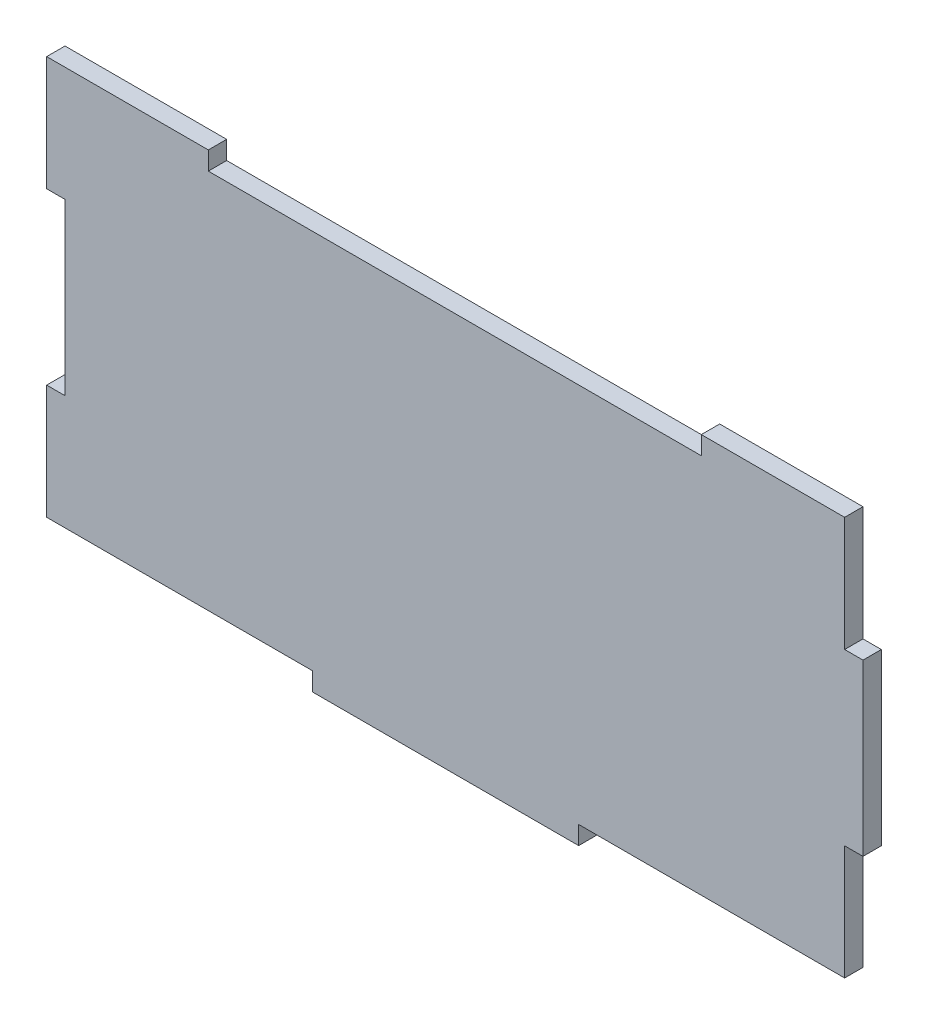
ISO-10303-21;
HEADER;
FILE_DESCRIPTION(('STEP AP214'),'2;1');
FILE_NAME('part.step','',(''),(''),'','','');
FILE_SCHEMA(('AUTOMOTIVE_DESIGN { 1 0 10303 214 1 1 1 1 }'));
ENDSEC;
DATA;
#1=APPLICATION_CONTEXT('core data for automotive mechanical design processes');
#2=APPLICATION_PROTOCOL_DEFINITION('international standard','automotive_design',2000,#1);
#3=PRODUCT_CONTEXT('',#1,'mechanical');
#4=PRODUCT('Part','Part','',(#3));
#5=PRODUCT_RELATED_PRODUCT_CATEGORY('part','',(#4));
#6=PRODUCT_DEFINITION_FORMATION('','',#4);
#7=PRODUCT_DEFINITION_CONTEXT('part definition',#1,'design');
#8=PRODUCT_DEFINITION('design','',#6,#7);
#9=PRODUCT_DEFINITION_SHAPE('','',#8);
#10=(LENGTH_UNIT() NAMED_UNIT(*) SI_UNIT(.MILLI.,.METRE.));
#11=(NAMED_UNIT(*) PLANE_ANGLE_UNIT() SI_UNIT($,.RADIAN.));
#12=(NAMED_UNIT(*) SI_UNIT($,.STERADIAN.) SOLID_ANGLE_UNIT());
#13=UNCERTAINTY_MEASURE_WITH_UNIT(LENGTH_MEASURE(1.E-05),#10,'distance_accuracy_value','');
#14=(GEOMETRIC_REPRESENTATION_CONTEXT(3) GLOBAL_UNCERTAINTY_ASSIGNED_CONTEXT((#13)) GLOBAL_UNIT_ASSIGNED_CONTEXT((#10,
#11,#12)) REPRESENTATION_CONTEXT('',''));
#15=CARTESIAN_POINT('',(0.,0.,0.));
#16=DIRECTION('',(0.,0.,1.));
#17=DIRECTION('',(1.,0.,0.));
#18=AXIS2_PLACEMENT_3D('',#15,#16,#17);
#19=CARTESIAN_POINT('',(0.,100.,4.6));
#20=DIRECTION('',(0.,-1.,0.));
#21=DIRECTION('',(0.,0.,-1.));
#22=AXIS2_PLACEMENT_3D('',#19,#20,#21);
#23=PLANE('',#22);
#24=DIRECTION('',(0.,0.,1.));
#25=VECTOR('',#24,1.);
#26=CARTESIAN_POINT('',(164.08357749269,99.9999999999319,0.));
#27=LINE('',#26,#25);
#28=CARTESIAN_POINT('',(164.08357749269,99.9999999999319,0.));
#29=VERTEX_POINT('',#28);
#30=CARTESIAN_POINT('',(164.08357749269,99.9999999999319,4.60000000000006));
#31=VERTEX_POINT('',#30);
#32=EDGE_CURVE('E579',#29,#31,#27,.T.);
#33=ORIENTED_EDGE('',*,*,#32,.T.);
#34=DIRECTION('',(-1.,0.,0.));
#35=VECTOR('',#34,1.);
#36=CARTESIAN_POINT('',(0.,100.,4.6));
#37=LINE('',#36,#35);
#38=CARTESIAN_POINT('',(200.,100.,4.6));
#39=VERTEX_POINT('',#38);
#40=EDGE_CURVE('E187',#39,#31,#37,.T.);
#41=ORIENTED_EDGE('',*,*,#40,.F.);
#42=DIRECTION('',(0.,0.,-1.));
#43=VECTOR('',#42,1.);
#44=CARTESIAN_POINT('',(200.,100.,4.6));
#45=LINE('',#44,#43);
#46=CARTESIAN_POINT('',(200.,100.,0.));
#47=VERTEX_POINT('',#46);
#48=EDGE_CURVE('E290',#39,#47,#45,.T.);
#49=ORIENTED_EDGE('',*,*,#48,.T.);
#50=DIRECTION('',(-1.,0.,0.));
#51=VECTOR('',#50,1.);
#52=CARTESIAN_POINT('',(0.,100.,0.));
#53=LINE('',#52,#51);
#54=EDGE_CURVE('E295',#47,#29,#53,.T.);
#55=ORIENTED_EDGE('',*,*,#54,.T.);
#56=EDGE_LOOP('',(#33,#41,#49,#55));
#57=FACE_BOUND('',#56,.T.);
#58=ADVANCED_FACE('F31',(#57),#23,.F.);
#59=DIRECTION('',(0.,0.,-1.));
#60=VECTOR('',#59,1.);
#61=CARTESIAN_POINT('',(40.51642250731,99.9999999999319,0.));
#62=LINE('',#61,#60);
#63=CARTESIAN_POINT('',(40.51642250731,99.9999999999319,4.60000000000007));
#64=VERTEX_POINT('',#63);
#65=CARTESIAN_POINT('',(40.51642250731,99.9999999999319,0.));
#66=VERTEX_POINT('',#65);
#67=EDGE_CURVE('E174',#64,#66,#62,.T.);
#68=ORIENTED_EDGE('',*,*,#67,.T.);
#69=CARTESIAN_POINT('',(0.,100.,0.));
#70=VERTEX_POINT('',#69);
#71=EDGE_CURVE('E299',#66,#70,#53,.T.);
#72=ORIENTED_EDGE('',*,*,#71,.T.);
#73=DIRECTION('',(0.,0.,-1.));
#74=VECTOR('',#73,1.);
#75=CARTESIAN_POINT('',(0.,100.,4.6));
#76=LINE('',#75,#74);
#77=CARTESIAN_POINT('',(0.,100.,4.6));
#78=VERTEX_POINT('',#77);
#79=EDGE_CURVE('E258',#78,#70,#76,.T.);
#80=ORIENTED_EDGE('',*,*,#79,.F.);
#81=EDGE_CURVE('E256',#64,#78,#37,.T.);
#82=ORIENTED_EDGE('',*,*,#81,.F.);
#83=EDGE_LOOP('',(#68,#72,#80,#82));
#84=FACE_BOUND('',#83,.T.);
#85=ADVANCED_FACE('F403',(#84),#23,.F.);
#86=CARTESIAN_POINT('',(0.,100.,4.6));
#87=DIRECTION('',(0.,0.,-1.));
#88=DIRECTION('',(-1.,0.,0.));
#89=AXIS2_PLACEMENT_3D('',#86,#87,#88);
#90=PLANE('',#89);
#91=DIRECTION('',(0.,1.,0.));
#92=VECTOR('',#91,1.);
#93=CARTESIAN_POINT('',(164.08357749269,95.3999999999319,4.60000000000006));
#94=LINE('',#93,#92);
#95=CARTESIAN_POINT('',(164.08357749269,95.3999999999319,4.60000000000006));
#96=VERTEX_POINT('',#95);
#97=EDGE_CURVE('E168',#96,#31,#94,.T.);
#98=ORIENTED_EDGE('',*,*,#97,.F.);
#99=DIRECTION('',(-1.,0.,0.));
#100=VECTOR('',#99,1.);
#101=CARTESIAN_POINT('',(40.51642250731,95.3999999999319,4.60000000000007));
#102=LINE('',#101,#100);
#103=CARTESIAN_POINT('',(40.51642250731,95.3999999999319,4.60000000000007));
#104=VERTEX_POINT('',#103);
#105=EDGE_CURVE('E173',#96,#104,#102,.T.);
#106=ORIENTED_EDGE('',*,*,#105,.T.);
#107=DIRECTION('',(0.,1.,0.));
#108=VECTOR('',#107,1.);
#109=CARTESIAN_POINT('',(40.51642250731,95.3999999999319,4.60000000000007));
#110=LINE('',#109,#108);
#111=EDGE_CURVE('E188',#104,#64,#110,.T.);
#112=ORIENTED_EDGE('',*,*,#111,.T.);
#113=ORIENTED_EDGE('',*,*,#81,.T.);
#114=DIRECTION('',(0.,-1.,0.));
#115=VECTOR('',#114,1.);
#116=CARTESIAN_POINT('',(0.,0.,4.6));
#117=LINE('',#116,#115);
#118=CARTESIAN_POINT('',(0.,71.3036640249381,4.6));
#119=VERTEX_POINT('',#118);
#120=EDGE_CURVE('E239',#78,#119,#117,.T.);
#121=ORIENTED_EDGE('',*,*,#120,.T.);
#122=DIRECTION('',(-1.,0.,0.));
#123=VECTOR('',#122,1.);
#124=CARTESIAN_POINT('',(0.,71.3036640249381,4.6));
#125=LINE('',#124,#123);
#126=CARTESIAN_POINT('',(4.6,71.3036640249381,4.6));
#127=VERTEX_POINT('',#126);
#128=EDGE_CURVE('E365',#127,#119,#125,.T.);
#129=ORIENTED_EDGE('',*,*,#128,.F.);
#130=DIRECTION('',(0.,1.,0.));
#131=VECTOR('',#130,1.);
#132=CARTESIAN_POINT('',(4.6,71.3036640249381,4.6));
#133=LINE('',#132,#131);
#134=CARTESIAN_POINT('',(4.59999999999999,28.6963359750618,4.6));
#135=VERTEX_POINT('',#134);
#136=EDGE_CURVE('E380',#135,#127,#133,.T.);
#137=ORIENTED_EDGE('',*,*,#136,.F.);
#138=DIRECTION('',(1.,0.,0.));
#139=VECTOR('',#138,1.);
#140=CARTESIAN_POINT('',(0.,28.6963359750618,4.6));
#141=LINE('',#140,#139);
#142=CARTESIAN_POINT('',(0.,28.6963359750618,4.6));
#143=VERTEX_POINT('',#142);
#144=EDGE_CURVE('E227',#143,#135,#141,.T.);
#145=ORIENTED_EDGE('',*,*,#144,.F.);
#146=CARTESIAN_POINT('',(0.,0.,4.6));
#147=VERTEX_POINT('',#146);
#148=EDGE_CURVE('E298',#143,#147,#117,.T.);
#149=ORIENTED_EDGE('',*,*,#148,.T.);
#150=DIRECTION('',(1.,0.,0.));
#151=VECTOR('',#150,1.);
#152=CARTESIAN_POINT('',(0.,0.,4.6));
#153=LINE('',#152,#151);
#154=CARTESIAN_POINT('',(66.6666666666667,0.,4.6));
#155=VERTEX_POINT('',#154);
#156=EDGE_CURVE('E238',#147,#155,#153,.T.);
#157=ORIENTED_EDGE('',*,*,#156,.T.);
#158=DIRECTION('',(0.,-1.,0.));
#159=VECTOR('',#158,1.);
#160=CARTESIAN_POINT('',(66.6666666666667,0.,4.6));
#161=LINE('',#160,#159);
#162=CARTESIAN_POINT('',(66.6666666666667,-4.60000000000001,4.6));
#163=VERTEX_POINT('',#162);
#164=EDGE_CURVE('E53',#155,#163,#161,.T.);
#165=ORIENTED_EDGE('',*,*,#164,.T.);
#166=DIRECTION('',(1.,0.,0.));
#167=VECTOR('',#166,1.);
#168=CARTESIAN_POINT('',(133.333333333333,-4.6,4.6));
#169=LINE('',#168,#167);
#170=CARTESIAN_POINT('',(133.333333333333,-4.6,4.6));
#171=VERTEX_POINT('',#170);
#172=EDGE_CURVE('E196',#163,#171,#169,.T.);
#173=ORIENTED_EDGE('',*,*,#172,.T.);
#174=DIRECTION('',(0.,1.,0.));
#175=VECTOR('',#174,1.);
#176=CARTESIAN_POINT('',(133.333333333333,0.,4.6));
#177=LINE('',#176,#175);
#178=CARTESIAN_POINT('',(133.333333333333,0.,4.6));
#179=VERTEX_POINT('',#178);
#180=EDGE_CURVE('E190',#171,#179,#177,.T.);
#181=ORIENTED_EDGE('',*,*,#180,.T.);
#182=CARTESIAN_POINT('',(200.,0.,4.6));
#183=VERTEX_POINT('',#182);
#184=EDGE_CURVE('E235',#179,#183,#153,.T.);
#185=ORIENTED_EDGE('',*,*,#184,.T.);
#186=DIRECTION('',(0.,1.,0.));
#187=VECTOR('',#186,1.);
#188=CARTESIAN_POINT('',(200.,0.,4.6));
#189=LINE('',#188,#187);
#190=CARTESIAN_POINT('',(200.,28.6963359750619,4.6));
#191=VERTEX_POINT('',#190);
#192=EDGE_CURVE('E245',#183,#191,#189,.T.);
#193=ORIENTED_EDGE('',*,*,#192,.T.);
#194=DIRECTION('',(1.,0.,0.));
#195=VECTOR('',#194,1.);
#196=CARTESIAN_POINT('',(200.,28.6963359750619,4.6));
#197=LINE('',#196,#195);
#198=CARTESIAN_POINT('',(204.6,28.6963359750619,4.6));
#199=VERTEX_POINT('',#198);
#200=EDGE_CURVE('E248',#191,#199,#197,.T.);
#201=ORIENTED_EDGE('',*,*,#200,.T.);
#202=DIRECTION('',(0.,1.,0.));
#203=VECTOR('',#202,1.);
#204=CARTESIAN_POINT('',(204.6,28.6963359750619,4.6));
#205=LINE('',#204,#203);
#206=CARTESIAN_POINT('',(204.6,71.3036640249381,4.6));
#207=VERTEX_POINT('',#206);
#208=EDGE_CURVE('E250',#199,#207,#205,.T.);
#209=ORIENTED_EDGE('',*,*,#208,.T.);
#210=DIRECTION('',(-1.,0.,0.));
#211=VECTOR('',#210,1.);
#212=CARTESIAN_POINT('',(200.,71.3036640249381,4.6));
#213=LINE('',#212,#211);
#214=CARTESIAN_POINT('',(200.,71.3036640249381,4.6));
#215=VERTEX_POINT('',#214);
#216=EDGE_CURVE('E252',#207,#215,#213,.T.);
#217=ORIENTED_EDGE('',*,*,#216,.T.);
#218=DIRECTION('',(0.,1.,0.));
#219=VECTOR('',#218,1.);
#220=CARTESIAN_POINT('',(200.,71.3036640249381,4.6));
#221=LINE('',#220,#219);
#222=EDGE_CURVE('E254',#215,#39,#221,.T.);
#223=ORIENTED_EDGE('',*,*,#222,.T.);
#224=ORIENTED_EDGE('',*,*,#40,.T.);
#225=EDGE_LOOP('',(#98,#106,#112,#113,#121,#129,#137,#145,#149,#157,#165,#173,#181,#185,#193,
#201,#209,#217,#223,#224));
#226=FACE_BOUND('',#225,.T.);
#227=ADVANCED_FACE('F185',(#226),#90,.F.);
#228=CARTESIAN_POINT('',(0.,100.,0.));
#229=DIRECTION('',(0.,0.,-1.));
#230=DIRECTION('',(-1.,0.,0.));
#231=AXIS2_PLACEMENT_3D('',#228,#229,#230);
#232=PLANE('',#231);
#233=DIRECTION('',(0.,-1.,0.));
#234=VECTOR('',#233,1.);
#235=CARTESIAN_POINT('',(0.,0.,0.));
#236=LINE('',#235,#234);
#237=CARTESIAN_POINT('',(0.,71.3036640249381,0.));
#238=VERTEX_POINT('',#237);
#239=EDGE_CURVE('E259',#70,#238,#236,.T.);
#240=ORIENTED_EDGE('',*,*,#239,.F.);
#241=ORIENTED_EDGE('',*,*,#71,.F.);
#242=DIRECTION('',(0.,1.,0.));
#243=VECTOR('',#242,1.);
#244=CARTESIAN_POINT('',(40.51642250731,95.3999999999319,0.));
#245=LINE('',#244,#243);
#246=CARTESIAN_POINT('',(40.51642250731,95.3999999999319,0.));
#247=VERTEX_POINT('',#246);
#248=EDGE_CURVE('E192',#247,#66,#245,.T.);
#249=ORIENTED_EDGE('',*,*,#248,.F.);
#250=DIRECTION('',(-1.,0.,0.));
#251=VECTOR('',#250,1.);
#252=CARTESIAN_POINT('',(0.,95.3999999999319,0.));
#253=LINE('',#252,#251);
#254=CARTESIAN_POINT('',(164.08357749269,95.3999999999319,0.));
#255=VERTEX_POINT('',#254);
#256=EDGE_CURVE('E11',#255,#247,#253,.T.);
#257=ORIENTED_EDGE('',*,*,#256,.F.);
#258=DIRECTION('',(0.,1.,0.));
#259=VECTOR('',#258,1.);
#260=CARTESIAN_POINT('',(164.08357749269,95.3999999999319,0.));
#261=LINE('',#260,#259);
#262=EDGE_CURVE('E171',#255,#29,#261,.T.);
#263=ORIENTED_EDGE('',*,*,#262,.T.);
#264=ORIENTED_EDGE('',*,*,#54,.F.);
#265=DIRECTION('',(0.,1.,0.));
#266=VECTOR('',#265,1.);
#267=CARTESIAN_POINT('',(200.,71.3036640249381,0.));
#268=LINE('',#267,#266);
#269=CARTESIAN_POINT('',(200.,71.3036640249381,0.));
#270=VERTEX_POINT('',#269);
#271=EDGE_CURVE('E300',#270,#47,#268,.T.);
#272=ORIENTED_EDGE('',*,*,#271,.F.);
#273=DIRECTION('',(-1.,0.,0.));
#274=VECTOR('',#273,1.);
#275=CARTESIAN_POINT('',(200.,71.3036640249381,0.));
#276=LINE('',#275,#274);
#277=CARTESIAN_POINT('',(204.6,71.3036640249381,0.));
#278=VERTEX_POINT('',#277);
#279=EDGE_CURVE('E302',#278,#270,#276,.T.);
#280=ORIENTED_EDGE('',*,*,#279,.F.);
#281=DIRECTION('',(0.,1.,0.));
#282=VECTOR('',#281,1.);
#283=CARTESIAN_POINT('',(204.6,28.6963359750619,0.));
#284=LINE('',#283,#282);
#285=CARTESIAN_POINT('',(204.6,28.6963359750619,0.));
#286=VERTEX_POINT('',#285);
#287=EDGE_CURVE('E304',#286,#278,#284,.T.);
#288=ORIENTED_EDGE('',*,*,#287,.F.);
#289=DIRECTION('',(1.,0.,0.));
#290=VECTOR('',#289,1.);
#291=CARTESIAN_POINT('',(200.,28.6963359750619,0.));
#292=LINE('',#291,#290);
#293=CARTESIAN_POINT('',(200.,28.6963359750619,0.));
#294=VERTEX_POINT('',#293);
#295=EDGE_CURVE('E305',#294,#286,#292,.T.);
#296=ORIENTED_EDGE('',*,*,#295,.F.);
#297=DIRECTION('',(0.,1.,0.));
#298=VECTOR('',#297,1.);
#299=CARTESIAN_POINT('',(200.,0.,0.));
#300=LINE('',#299,#298);
#301=CARTESIAN_POINT('',(200.,0.,0.));
#302=VERTEX_POINT('',#301);
#303=EDGE_CURVE('E266',#302,#294,#300,.T.);
#304=ORIENTED_EDGE('',*,*,#303,.F.);
#305=DIRECTION('',(1.,0.,0.));
#306=VECTOR('',#305,1.);
#307=CARTESIAN_POINT('',(0.,0.,0.));
#308=LINE('',#307,#306);
#309=CARTESIAN_POINT('',(133.333333333333,0.,0.));
#310=VERTEX_POINT('',#309);
#311=EDGE_CURVE('E262',#310,#302,#308,.T.);
#312=ORIENTED_EDGE('',*,*,#311,.F.);
#313=DIRECTION('',(0.,1.,0.));
#314=VECTOR('',#313,1.);
#315=CARTESIAN_POINT('',(133.333333333333,0.,0.));
#316=LINE('',#315,#314);
#317=CARTESIAN_POINT('',(133.333333333333,-4.6,0.));
#318=VERTEX_POINT('',#317);
#319=EDGE_CURVE('E206',#318,#310,#316,.T.);
#320=ORIENTED_EDGE('',*,*,#319,.F.);
#321=DIRECTION('',(1.,0.,0.));
#322=VECTOR('',#321,1.);
#323=CARTESIAN_POINT('',(133.333333333333,-4.6,0.));
#324=LINE('',#323,#322);
#325=CARTESIAN_POINT('',(66.6666666666667,-4.60000000000001,0.));
#326=VERTEX_POINT('',#325);
#327=EDGE_CURVE('E200',#326,#318,#324,.T.);
#328=ORIENTED_EDGE('',*,*,#327,.F.);
#329=DIRECTION('',(0.,-1.,0.));
#330=VECTOR('',#329,1.);
#331=CARTESIAN_POINT('',(66.6666666666667,0.,0.));
#332=LINE('',#331,#330);
#333=CARTESIAN_POINT('',(66.6666666666667,0.,0.));
#334=VERTEX_POINT('',#333);
#335=EDGE_CURVE('E208',#334,#326,#332,.T.);
#336=ORIENTED_EDGE('',*,*,#335,.F.);
#337=CARTESIAN_POINT('',(0.,0.,0.));
#338=VERTEX_POINT('',#337);
#339=EDGE_CURVE('E270',#338,#334,#308,.T.);
#340=ORIENTED_EDGE('',*,*,#339,.F.);
#341=CARTESIAN_POINT('',(0.,28.6963359750618,0.));
#342=VERTEX_POINT('',#341);
#343=EDGE_CURVE('E263',#342,#338,#236,.T.);
#344=ORIENTED_EDGE('',*,*,#343,.F.);
#345=DIRECTION('',(1.,0.,0.));
#346=VECTOR('',#345,1.);
#347=CARTESIAN_POINT('',(0.,28.6963359750618,0.));
#348=LINE('',#347,#346);
#349=CARTESIAN_POINT('',(4.59999999999999,28.6963359750618,0.));
#350=VERTEX_POINT('',#349);
#351=EDGE_CURVE('E377',#342,#350,#348,.T.);
#352=ORIENTED_EDGE('',*,*,#351,.T.);
#353=DIRECTION('',(0.,1.,0.));
#354=VECTOR('',#353,1.);
#355=CARTESIAN_POINT('',(4.6,71.3036640249381,0.));
#356=LINE('',#355,#354);
#357=CARTESIAN_POINT('',(4.6,71.3036640249381,0.));
#358=VERTEX_POINT('',#357);
#359=EDGE_CURVE('E373',#350,#358,#356,.T.);
#360=ORIENTED_EDGE('',*,*,#359,.T.);
#361=DIRECTION('',(-1.,0.,0.));
#362=VECTOR('',#361,1.);
#363=CARTESIAN_POINT('',(0.,71.3036640249381,0.));
#364=LINE('',#363,#362);
#365=EDGE_CURVE('E368',#358,#238,#364,.T.);
#366=ORIENTED_EDGE('',*,*,#365,.T.);
#367=EDGE_LOOP('',(#240,#241,#249,#257,#263,#264,#272,#280,#288,#296,#304,#312,#320,#328,#336,
#340,#344,#352,#360,#366));
#368=FACE_BOUND('',#367,.T.);
#369=ADVANCED_FACE('F321',(#368),#232,.T.);
#370=CARTESIAN_POINT('',(0.,0.,4.6));
#371=DIRECTION('',(0.,1.,0.));
#372=DIRECTION('',(0.,0.,1.));
#373=AXIS2_PLACEMENT_3D('',#370,#371,#372);
#374=PLANE('',#373);
#375=DIRECTION('',(0.,0.,1.));
#376=VECTOR('',#375,1.);
#377=CARTESIAN_POINT('',(133.333333333333,0.,-66.8251782223171));
#378=LINE('',#377,#376);
#379=EDGE_CURVE('E223',#310,#179,#378,.T.);
#380=ORIENTED_EDGE('',*,*,#379,.F.);
#381=ORIENTED_EDGE('',*,*,#311,.T.);
#382=DIRECTION('',(0.,0.,-1.));
#383=VECTOR('',#382,1.);
#384=CARTESIAN_POINT('',(200.,0.,4.6));
#385=LINE('',#384,#383);
#386=EDGE_CURVE('E275',#183,#302,#385,.T.);
#387=ORIENTED_EDGE('',*,*,#386,.F.);
#388=ORIENTED_EDGE('',*,*,#184,.F.);
#389=EDGE_LOOP('',(#380,#381,#387,#388));
#390=FACE_BOUND('',#389,.T.);
#391=ADVANCED_FACE('F336',(#390),#374,.F.);
#392=CARTESIAN_POINT('',(0.,0.,4.6));
#393=DIRECTION('',(1.,0.,0.));
#394=DIRECTION('',(0.,0.,-1.));
#395=AXIS2_PLACEMENT_3D('',#392,#393,#394);
#396=PLANE('',#395);
#397=ORIENTED_EDGE('',*,*,#239,.T.);
#398=DIRECTION('',(0.,0.,1.));
#399=VECTOR('',#398,1.);
#400=CARTESIAN_POINT('',(0.,71.3036640249381,0.));
#401=LINE('',#400,#399);
#402=EDGE_CURVE('E355',#238,#119,#401,.T.);
#403=ORIENTED_EDGE('',*,*,#402,.T.);
#404=ORIENTED_EDGE('',*,*,#120,.F.);
#405=ORIENTED_EDGE('',*,*,#79,.T.);
#406=EDGE_LOOP('',(#397,#403,#404,#405));
#407=FACE_BOUND('',#406,.T.);
#408=ADVANCED_FACE('F425',(#407),#396,.F.);
#409=ORIENTED_EDGE('',*,*,#148,.F.);
#410=DIRECTION('',(0.,0.,1.));
#411=VECTOR('',#410,1.);
#412=CARTESIAN_POINT('',(0.,28.6963359750618,0.));
#413=LINE('',#412,#411);
#414=EDGE_CURVE('E354',#342,#143,#413,.T.);
#415=ORIENTED_EDGE('',*,*,#414,.F.);
#416=ORIENTED_EDGE('',*,*,#343,.T.);
#417=DIRECTION('',(0.,0.,-1.));
#418=VECTOR('',#417,1.);
#419=CARTESIAN_POINT('',(0.,0.,4.6));
#420=LINE('',#419,#418);
#421=EDGE_CURVE('E39',#147,#338,#420,.T.);
#422=ORIENTED_EDGE('',*,*,#421,.F.);
#423=EDGE_LOOP('',(#409,#415,#416,#422));
#424=FACE_BOUND('',#423,.T.);
#425=ADVANCED_FACE('F33',(#424),#396,.F.);
#426=ORIENTED_EDGE('',*,*,#339,.T.);
#427=DIRECTION('',(0.,0.,1.));
#428=VECTOR('',#427,1.);
#429=CARTESIAN_POINT('',(66.6666666666667,0.,-66.8251782223171));
#430=LINE('',#429,#428);
#431=EDGE_CURVE('E199',#334,#155,#430,.T.);
#432=ORIENTED_EDGE('',*,*,#431,.T.);
#433=ORIENTED_EDGE('',*,*,#156,.F.);
#434=ORIENTED_EDGE('',*,*,#421,.T.);
#435=EDGE_LOOP('',(#426,#432,#433,#434));
#436=FACE_BOUND('',#435,.T.);
#437=ADVANCED_FACE('F350',(#436),#374,.F.);
#438=CARTESIAN_POINT('',(200.,0.,4.6));
#439=DIRECTION('',(-1.,0.,0.));
#440=DIRECTION('',(0.,0.,1.));
#441=AXIS2_PLACEMENT_3D('',#438,#439,#440);
#442=PLANE('',#441);
#443=ORIENTED_EDGE('',*,*,#303,.T.);
#444=DIRECTION('',(0.,0.,-1.));
#445=VECTOR('',#444,1.);
#446=CARTESIAN_POINT('',(200.,28.6963359750619,4.6));
#447=LINE('',#446,#445);
#448=EDGE_CURVE('E278',#191,#294,#447,.T.);
#449=ORIENTED_EDGE('',*,*,#448,.F.);
#450=ORIENTED_EDGE('',*,*,#192,.F.);
#451=ORIENTED_EDGE('',*,*,#386,.T.);
#452=EDGE_LOOP('',(#443,#449,#450,#451));
#453=FACE_BOUND('',#452,.T.);
#454=ADVANCED_FACE('F312',(#453),#442,.F.);
#455=CARTESIAN_POINT('',(200.,28.6963359750619,4.6));
#456=DIRECTION('',(0.,1.,0.));
#457=DIRECTION('',(0.,0.,1.));
#458=AXIS2_PLACEMENT_3D('',#455,#456,#457);
#459=PLANE('',#458);
#460=ORIENTED_EDGE('',*,*,#295,.T.);
#461=DIRECTION('',(0.,0.,-1.));
#462=VECTOR('',#461,1.);
#463=CARTESIAN_POINT('',(204.6,28.6963359750619,4.6));
#464=LINE('',#463,#462);
#465=EDGE_CURVE('E281',#199,#286,#464,.T.);
#466=ORIENTED_EDGE('',*,*,#465,.F.);
#467=ORIENTED_EDGE('',*,*,#200,.F.);
#468=ORIENTED_EDGE('',*,*,#448,.T.);
#469=EDGE_LOOP('',(#460,#466,#467,#468));
#470=FACE_BOUND('',#469,.T.);
#471=ADVANCED_FACE('F318',(#470),#459,.F.);
#472=CARTESIAN_POINT('',(204.6,28.6963359750619,4.6));
#473=DIRECTION('',(-1.,0.,0.));
#474=DIRECTION('',(0.,0.,1.));
#475=AXIS2_PLACEMENT_3D('',#472,#473,#474);
#476=PLANE('',#475);
#477=ORIENTED_EDGE('',*,*,#287,.T.);
#478=DIRECTION('',(0.,0.,-1.));
#479=VECTOR('',#478,1.);
#480=CARTESIAN_POINT('',(204.6,71.3036640249381,4.6));
#481=LINE('',#480,#479);
#482=EDGE_CURVE('E284',#207,#278,#481,.T.);
#483=ORIENTED_EDGE('',*,*,#482,.F.);
#484=ORIENTED_EDGE('',*,*,#208,.F.);
#485=ORIENTED_EDGE('',*,*,#465,.T.);
#486=EDGE_LOOP('',(#477,#483,#484,#485));
#487=FACE_BOUND('',#486,.T.);
#488=ADVANCED_FACE('F326',(#487),#476,.F.);
#489=CARTESIAN_POINT('',(200.,71.3036640249381,4.6));
#490=DIRECTION('',(0.,-1.,0.));
#491=DIRECTION('',(0.,0.,-1.));
#492=AXIS2_PLACEMENT_3D('',#489,#490,#491);
#493=PLANE('',#492);
#494=ORIENTED_EDGE('',*,*,#279,.T.);
#495=DIRECTION('',(0.,0.,-1.));
#496=VECTOR('',#495,1.);
#497=CARTESIAN_POINT('',(200.,71.3036640249381,4.6));
#498=LINE('',#497,#496);
#499=EDGE_CURVE('E287',#215,#270,#498,.T.);
#500=ORIENTED_EDGE('',*,*,#499,.F.);
#501=ORIENTED_EDGE('',*,*,#216,.F.);
#502=ORIENTED_EDGE('',*,*,#482,.T.);
#503=EDGE_LOOP('',(#494,#500,#501,#502));
#504=FACE_BOUND('',#503,.T.);
#505=ADVANCED_FACE('F330',(#504),#493,.F.);
#506=CARTESIAN_POINT('',(200.,71.3036640249381,4.6));
#507=DIRECTION('',(-1.,0.,0.));
#508=DIRECTION('',(0.,0.,1.));
#509=AXIS2_PLACEMENT_3D('',#506,#507,#508);
#510=PLANE('',#509);
#511=ORIENTED_EDGE('',*,*,#271,.T.);
#512=ORIENTED_EDGE('',*,*,#48,.F.);
#513=ORIENTED_EDGE('',*,*,#222,.F.);
#514=ORIENTED_EDGE('',*,*,#499,.T.);
#515=EDGE_LOOP('',(#511,#512,#513,#514));
#516=FACE_BOUND('',#515,.T.);
#517=ADVANCED_FACE('F391',(#516),#510,.F.);
#518=CARTESIAN_POINT('',(0.,71.3036640249381,0.));
#519=DIRECTION('',(0.,1.,0.));
#520=DIRECTION('',(0.,0.,1.));
#521=AXIS2_PLACEMENT_3D('',#518,#519,#520);
#522=PLANE('',#521);
#523=ORIENTED_EDGE('',*,*,#128,.T.);
#524=ORIENTED_EDGE('',*,*,#402,.F.);
#525=ORIENTED_EDGE('',*,*,#365,.F.);
#526=DIRECTION('',(0.,0.,1.));
#527=VECTOR('',#526,1.);
#528=CARTESIAN_POINT('',(4.6,71.3036640249381,0.));
#529=LINE('',#528,#527);
#530=EDGE_CURVE('E357',#358,#127,#529,.T.);
#531=ORIENTED_EDGE('',*,*,#530,.T.);
#532=EDGE_LOOP('',(#523,#524,#525,#531));
#533=FACE_BOUND('',#532,.T.);
#534=ADVANCED_FACE('F389',(#533),#522,.F.);
#535=CARTESIAN_POINT('',(4.6,71.3036640249381,0.));
#536=DIRECTION('',(1.,0.,0.));
#537=DIRECTION('',(0.,1.,0.));
#538=AXIS2_PLACEMENT_3D('',#535,#536,#537);
#539=PLANE('',#538);
#540=ORIENTED_EDGE('',*,*,#136,.T.);
#541=ORIENTED_EDGE('',*,*,#530,.F.);
#542=ORIENTED_EDGE('',*,*,#359,.F.);
#543=DIRECTION('',(0.,0.,1.));
#544=VECTOR('',#543,1.);
#545=CARTESIAN_POINT('',(4.59999999999999,28.6963359750618,0.));
#546=LINE('',#545,#544);
#547=EDGE_CURVE('E362',#350,#135,#546,.T.);
#548=ORIENTED_EDGE('',*,*,#547,.T.);
#549=EDGE_LOOP('',(#540,#541,#542,#548));
#550=FACE_BOUND('',#549,.T.);
#551=ADVANCED_FACE('F388',(#550),#539,.F.);
#552=CARTESIAN_POINT('',(0.,28.6963359750618,0.));
#553=DIRECTION('',(0.,-1.,0.));
#554=DIRECTION('',(1.,0.,0.));
#555=AXIS2_PLACEMENT_3D('',#552,#553,#554);
#556=PLANE('',#555);
#557=ORIENTED_EDGE('',*,*,#144,.T.);
#558=ORIENTED_EDGE('',*,*,#547,.F.);
#559=ORIENTED_EDGE('',*,*,#351,.F.);
#560=ORIENTED_EDGE('',*,*,#414,.T.);
#561=EDGE_LOOP('',(#557,#558,#559,#560));
#562=FACE_BOUND('',#561,.T.);
#563=ADVANCED_FACE('F387',(#562),#556,.F.);
#564=CARTESIAN_POINT('',(66.6666666666667,0.,-66.8251782223171));
#565=DIRECTION('',(-1.,0.,0.));
#566=DIRECTION('',(0.,0.,1.));
#567=AXIS2_PLACEMENT_3D('',#564,#565,#566);
#568=PLANE('',#567);
#569=ORIENTED_EDGE('',*,*,#431,.F.);
#570=ORIENTED_EDGE('',*,*,#335,.T.);
#571=DIRECTION('',(0.,0.,1.));
#572=VECTOR('',#571,1.);
#573=CARTESIAN_POINT('',(66.6666666666667,-4.60000000000001,-66.8251782223171));
#574=LINE('',#573,#572);
#575=EDGE_CURVE('E204',#326,#163,#574,.T.);
#576=ORIENTED_EDGE('',*,*,#575,.T.);
#577=ORIENTED_EDGE('',*,*,#164,.F.);
#578=EDGE_LOOP('',(#569,#570,#576,#577));
#579=FACE_BOUND('',#578,.T.);
#580=ADVANCED_FACE('F343',(#579),#568,.T.);
#581=CARTESIAN_POINT('',(133.333333333333,-4.6,-66.8251782223171));
#582=DIRECTION('',(0.,-1.,0.));
#583=DIRECTION('',(1.,0.,0.));
#584=AXIS2_PLACEMENT_3D('',#581,#582,#583);
#585=PLANE('',#584);
#586=ORIENTED_EDGE('',*,*,#575,.F.);
#587=ORIENTED_EDGE('',*,*,#327,.T.);
#588=DIRECTION('',(0.,0.,1.));
#589=VECTOR('',#588,1.);
#590=CARTESIAN_POINT('',(133.333333333333,-4.6,-66.8251782223171));
#591=LINE('',#590,#589);
#592=EDGE_CURVE('E203',#318,#171,#591,.T.);
#593=ORIENTED_EDGE('',*,*,#592,.T.);
#594=ORIENTED_EDGE('',*,*,#172,.F.);
#595=EDGE_LOOP('',(#586,#587,#593,#594));
#596=FACE_BOUND('',#595,.T.);
#597=ADVANCED_FACE('F342',(#596),#585,.T.);
#598=CARTESIAN_POINT('',(133.333333333333,0.,-66.8251782223171));
#599=DIRECTION('',(1.,0.,0.));
#600=DIRECTION('',(0.,0.,-1.));
#601=AXIS2_PLACEMENT_3D('',#598,#599,#600);
#602=PLANE('',#601);
#603=ORIENTED_EDGE('',*,*,#592,.F.);
#604=ORIENTED_EDGE('',*,*,#319,.T.);
#605=ORIENTED_EDGE('',*,*,#379,.T.);
#606=ORIENTED_EDGE('',*,*,#180,.F.);
#607=EDGE_LOOP('',(#603,#604,#605,#606));
#608=FACE_BOUND('',#607,.T.);
#609=ADVANCED_FACE('F340',(#608),#602,.T.);
#610=CARTESIAN_POINT('',(164.08357749269,95.3999999999319,0.));
#611=DIRECTION('',(-1.,0.,0.));
#612=DIRECTION('',(0.,0.,-1.));
#613=AXIS2_PLACEMENT_3D('',#610,#611,#612);
#614=PLANE('',#613);
#615=ORIENTED_EDGE('',*,*,#32,.F.);
#616=ORIENTED_EDGE('',*,*,#262,.F.);
#617=DIRECTION('',(0.,0.,1.));
#618=VECTOR('',#617,1.);
#619=CARTESIAN_POINT('',(164.08357749269,95.3999999999319,0.));
#620=LINE('',#619,#618);
#621=EDGE_CURVE('E45',#255,#96,#620,.T.);
#622=ORIENTED_EDGE('',*,*,#621,.T.);
#623=ORIENTED_EDGE('',*,*,#97,.T.);
#624=EDGE_LOOP('',(#615,#616,#622,#623));
#625=FACE_BOUND('',#624,.T.);
#626=ADVANCED_FACE('F166',(#625),#614,.T.);
#627=CARTESIAN_POINT('',(40.51642250731,95.3999999999319,0.));
#628=DIRECTION('',(1.,0.,0.));
#629=DIRECTION('',(0.,-1.,0.));
#630=AXIS2_PLACEMENT_3D('',#627,#628,#629);
#631=PLANE('',#630);
#632=ORIENTED_EDGE('',*,*,#67,.F.);
#633=ORIENTED_EDGE('',*,*,#111,.F.);
#634=DIRECTION('',(0.,0.,-1.));
#635=VECTOR('',#634,1.);
#636=CARTESIAN_POINT('',(40.51642250731,95.3999999999319,0.));
#637=LINE('',#636,#635);
#638=EDGE_CURVE('E180',#104,#247,#637,.T.);
#639=ORIENTED_EDGE('',*,*,#638,.T.);
#640=ORIENTED_EDGE('',*,*,#248,.T.);
#641=EDGE_LOOP('',(#632,#633,#639,#640));
#642=FACE_BOUND('',#641,.T.);
#643=ADVANCED_FACE('F450',(#642),#631,.T.);
#644=CARTESIAN_POINT('',(200.,95.3999999999319,-195.4));
#645=DIRECTION('',(0.,-1.,0.));
#646=DIRECTION('',(0.,0.,-1.));
#647=AXIS2_PLACEMENT_3D('',#644,#645,#646);
#648=PLANE('',#647);
#649=ORIENTED_EDGE('',*,*,#256,.T.);
#650=ORIENTED_EDGE('',*,*,#638,.F.);
#651=ORIENTED_EDGE('',*,*,#105,.F.);
#652=ORIENTED_EDGE('',*,*,#621,.F.);
#653=EDGE_LOOP('',(#649,#650,#651,#652));
#654=FACE_BOUND('',#653,.T.);
#655=ADVANCED_FACE('F178',(#654),#648,.F.);
#656=CLOSED_SHELL('',(#58,#85,#227,#369,#391,#408,#425,#437,#454,#471,#488,#505,#517,#534,#551,
#563,#580,#597,#609,#626,#643,#655));
#657=MANIFOLD_SOLID_BREP('B2',#656);
#658=ADVANCED_BREP_SHAPE_REPRESENTATION('',(#18,#657),#14);
#659=SHAPE_DEFINITION_REPRESENTATION(#9,#658);
ENDSEC;
END-ISO-10303-21;
